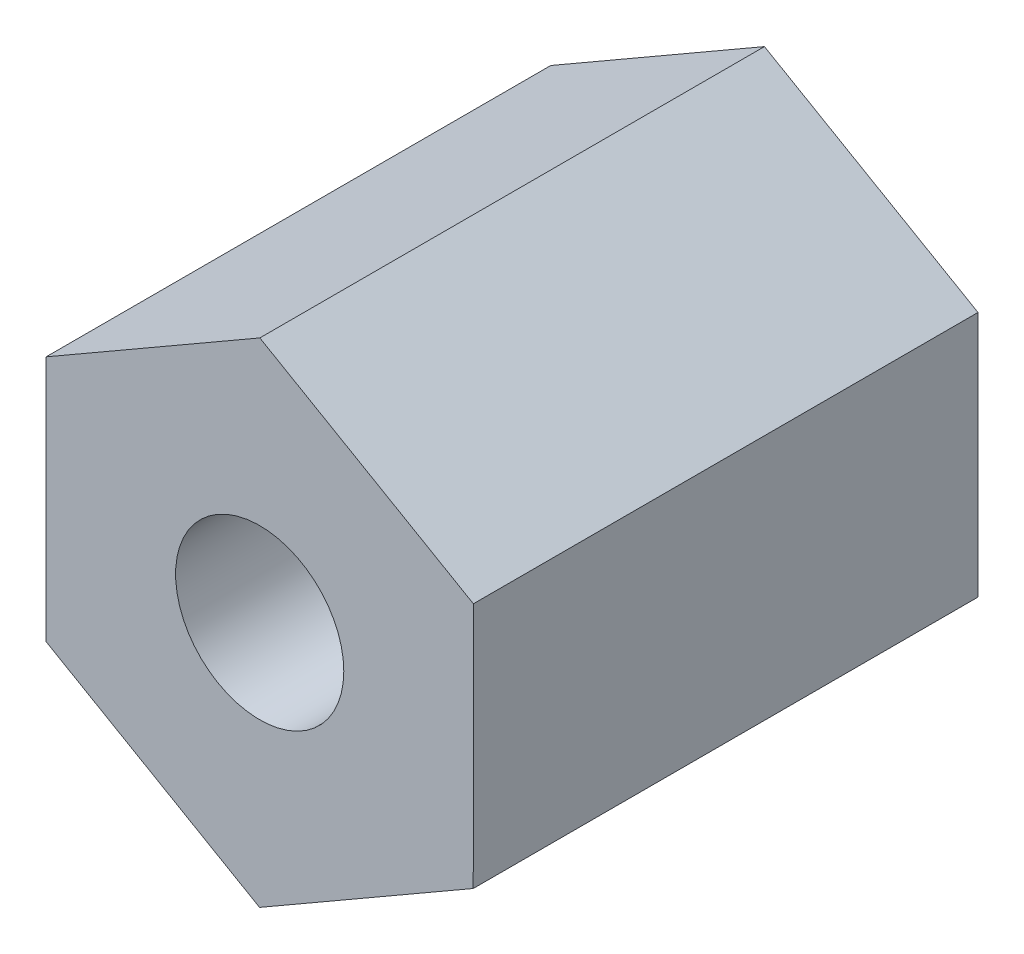
ISO-10303-21;
HEADER;
FILE_DESCRIPTION(('STEP AP214'),'2;1');
FILE_NAME('part.step','',(''),(''),'','','');
FILE_SCHEMA(('AUTOMOTIVE_DESIGN { 1 0 10303 214 1 1 1 1 }'));
ENDSEC;
DATA;
#1=APPLICATION_CONTEXT('core data for automotive mechanical design processes');
#2=APPLICATION_PROTOCOL_DEFINITION('international standard','automotive_design',2000,#1);
#3=PRODUCT_CONTEXT('',#1,'mechanical');
#4=PRODUCT('Part','Part','',(#3));
#5=PRODUCT_RELATED_PRODUCT_CATEGORY('part','',(#4));
#6=PRODUCT_DEFINITION_FORMATION('','',#4);
#7=PRODUCT_DEFINITION_CONTEXT('part definition',#1,'design');
#8=PRODUCT_DEFINITION('design','',#6,#7);
#9=PRODUCT_DEFINITION_SHAPE('','',#8);
#10=(LENGTH_UNIT() NAMED_UNIT(*) SI_UNIT(.MILLI.,.METRE.));
#11=(NAMED_UNIT(*) PLANE_ANGLE_UNIT() SI_UNIT($,.RADIAN.));
#12=(NAMED_UNIT(*) SI_UNIT($,.STERADIAN.) SOLID_ANGLE_UNIT());
#13=UNCERTAINTY_MEASURE_WITH_UNIT(LENGTH_MEASURE(1.E-05),#10,'distance_accuracy_value','');
#14=(GEOMETRIC_REPRESENTATION_CONTEXT(3) GLOBAL_UNCERTAINTY_ASSIGNED_CONTEXT((#13)) GLOBAL_UNIT_ASSIGNED_CONTEXT((#10,
#11,#12)) REPRESENTATION_CONTEXT('',''));
#15=CARTESIAN_POINT('',(0.,0.,0.));
#16=DIRECTION('',(0.,0.,1.));
#17=DIRECTION('',(1.,0.,0.));
#18=AXIS2_PLACEMENT_3D('',#15,#16,#17);
#19=CARTESIAN_POINT('',(0.,0.,15.));
#20=DIRECTION('',(0.,0.,1.));
#21=DIRECTION('',(1.,0.,0.));
#22=AXIS2_PLACEMENT_3D('',#19,#20,#21);
#23=PLANE('',#22);
#24=DIRECTION('',(0.866312371521047,0.499502627570246,0.));
#25=VECTOR('',#24,1.);
#26=CARTESIAN_POINT('',(-0.00421038864380795,-7.3323472098613,15.));
#27=LINE('',#26,#25);
#28=CARTESIAN_POINT('',(-0.00421038864380795,-7.3323472098613,15.));
#29=VERTEX_POINT('',#28);
#30=CARTESIAN_POINT('',(6.34789375878593,-3.669819908456,15.));
#31=VERTEX_POINT('',#30);
#32=EDGE_CURVE('E146',#29,#31,#27,.T.);
#33=ORIENTED_EDGE('',*,*,#32,.T.);
#34=DIRECTION('',(0.000574221027613144,0.999999835135092,0.));
#35=VECTOR('',#34,1.);
#36=CARTESIAN_POINT('',(6.34789375878593,-3.669819908456,15.));
#37=LINE('',#36,#35);
#38=CARTESIAN_POINT('',(6.35210414742974,3.6625273014053,15.));
#39=VERTEX_POINT('',#38);
#40=EDGE_CURVE('E94',#31,#39,#37,.T.);
#41=ORIENTED_EDGE('',*,*,#40,.T.);
#42=DIRECTION('',(-0.865738150493434,0.500497207564846,0.));
#43=VECTOR('',#42,1.);
#44=CARTESIAN_POINT('',(6.35210414742974,3.6625273014053,15.));
#45=LINE('',#44,#43);
#46=CARTESIAN_POINT('',(0.00421038864380947,7.3323472098613,15.));
#47=VERTEX_POINT('',#46);
#48=EDGE_CURVE('E107',#39,#47,#45,.T.);
#49=ORIENTED_EDGE('',*,*,#48,.T.);
#50=DIRECTION('',(-0.866312371521047,-0.499502627570246,0.));
#51=VECTOR('',#50,1.);
#52=CARTESIAN_POINT('',(0.00421038864380947,7.3323472098613,15.));
#53=LINE('',#52,#51);
#54=CARTESIAN_POINT('',(-6.34789375878593,3.66981990845599,15.));
#55=VERTEX_POINT('',#54);
#56=EDGE_CURVE('E101',#47,#55,#53,.T.);
#57=ORIENTED_EDGE('',*,*,#56,.T.);
#58=DIRECTION('',(-0.000574221027613499,-0.999999835135092,0.));
#59=VECTOR('',#58,1.);
#60=CARTESIAN_POINT('',(-6.34789375878593,3.66981990845599,15.));
#61=LINE('',#60,#59);
#62=CARTESIAN_POINT('',(-6.35210414742974,-3.6625273014053,15.));
#63=VERTEX_POINT('',#62);
#64=EDGE_CURVE('E105',#55,#63,#61,.T.);
#65=ORIENTED_EDGE('',*,*,#64,.T.);
#66=DIRECTION('',(0.865738150493433,-0.500497207564847,0.));
#67=VECTOR('',#66,1.);
#68=CARTESIAN_POINT('',(-6.35210414742974,-3.6625273014053,15.));
#69=LINE('',#68,#67);
#70=EDGE_CURVE('E57',#63,#29,#69,.T.);
#71=ORIENTED_EDGE('',*,*,#70,.T.);
#72=EDGE_LOOP('',(#33,#41,#49,#57,#65,#71));
#73=FACE_BOUND('',#72,.T.);
#74=CARTESIAN_POINT('',(0.,0.,15.));
#75=DIRECTION('',(0.,0.,1.));
#76=DIRECTION('',(1.,0.,0.));
#77=AXIS2_PLACEMENT_3D('',#74,#75,#76);
#78=CIRCLE('',#77,2.5);
#79=CARTESIAN_POINT('',(2.5,0.,15.));
#80=VERTEX_POINT('',#79);
#81=EDGE_CURVE('E134',#80,#80,#78,.T.);
#82=ORIENTED_EDGE('',*,*,#81,.F.);
#83=EDGE_LOOP('',(#82));
#84=FACE_BOUND('',#83,.T.);
#85=ADVANCED_FACE('F39',(#73,#84),#23,.T.);
#86=CARTESIAN_POINT('',(0.,0.,0.));
#87=DIRECTION('',(0.,0.,1.));
#88=DIRECTION('',(1.,0.,0.));
#89=AXIS2_PLACEMENT_3D('',#86,#87,#88);
#90=PLANE('',#89);
#91=DIRECTION('',(0.866312371521047,0.499502627570246,0.));
#92=VECTOR('',#91,1.);
#93=CARTESIAN_POINT('',(-0.00421038864380795,-7.3323472098613,0.));
#94=LINE('',#93,#92);
#95=CARTESIAN_POINT('',(-0.00421038864380795,-7.3323472098613,0.));
#96=VERTEX_POINT('',#95);
#97=CARTESIAN_POINT('',(6.34789375878593,-3.669819908456,0.));
#98=VERTEX_POINT('',#97);
#99=EDGE_CURVE('E129',#96,#98,#94,.T.);
#100=ORIENTED_EDGE('',*,*,#99,.F.);
#101=DIRECTION('',(0.865738150493433,-0.500497207564847,0.));
#102=VECTOR('',#101,1.);
#103=CARTESIAN_POINT('',(-6.35210414742974,-3.6625273014053,0.));
#104=LINE('',#103,#102);
#105=CARTESIAN_POINT('',(-6.35210414742974,-3.6625273014053,0.));
#106=VERTEX_POINT('',#105);
#107=EDGE_CURVE('E86',#106,#96,#104,.T.);
#108=ORIENTED_EDGE('',*,*,#107,.F.);
#109=DIRECTION('',(-0.000574221027613499,-0.999999835135092,0.));
#110=VECTOR('',#109,1.);
#111=CARTESIAN_POINT('',(-6.34789375878593,3.66981990845599,0.));
#112=LINE('',#111,#110);
#113=CARTESIAN_POINT('',(-6.34789375878593,3.66981990845599,0.));
#114=VERTEX_POINT('',#113);
#115=EDGE_CURVE('E80',#114,#106,#112,.T.);
#116=ORIENTED_EDGE('',*,*,#115,.F.);
#117=DIRECTION('',(-0.866312371521047,-0.499502627570246,0.));
#118=VECTOR('',#117,1.);
#119=CARTESIAN_POINT('',(0.00421038864380947,7.3323472098613,0.));
#120=LINE('',#119,#118);
#121=CARTESIAN_POINT('',(0.00421038864380947,7.3323472098613,0.));
#122=VERTEX_POINT('',#121);
#123=EDGE_CURVE('E116',#122,#114,#120,.T.);
#124=ORIENTED_EDGE('',*,*,#123,.F.);
#125=DIRECTION('',(-0.865738150493434,0.500497207564846,0.));
#126=VECTOR('',#125,1.);
#127=CARTESIAN_POINT('',(6.35210414742974,3.6625273014053,0.));
#128=LINE('',#127,#126);
#129=CARTESIAN_POINT('',(6.35210414742974,3.6625273014053,0.));
#130=VERTEX_POINT('',#129);
#131=EDGE_CURVE('E137',#130,#122,#128,.T.);
#132=ORIENTED_EDGE('',*,*,#131,.F.);
#133=DIRECTION('',(0.000574221027613144,0.999999835135092,0.));
#134=VECTOR('',#133,1.);
#135=CARTESIAN_POINT('',(6.34789375878593,-3.669819908456,0.));
#136=LINE('',#135,#134);
#137=EDGE_CURVE('E133',#98,#130,#136,.T.);
#138=ORIENTED_EDGE('',*,*,#137,.F.);
#139=EDGE_LOOP('',(#100,#108,#116,#124,#132,#138));
#140=FACE_BOUND('',#139,.T.);
#141=CARTESIAN_POINT('',(0.,0.,0.));
#142=DIRECTION('',(0.,0.,1.));
#143=DIRECTION('',(1.,0.,0.));
#144=AXIS2_PLACEMENT_3D('',#141,#142,#143);
#145=CIRCLE('',#144,2.5);
#146=CARTESIAN_POINT('',(2.5,0.,0.));
#147=VERTEX_POINT('',#146);
#148=EDGE_CURVE('E243',#147,#147,#145,.T.);
#149=ORIENTED_EDGE('',*,*,#148,.T.);
#150=EDGE_LOOP('',(#149));
#151=FACE_BOUND('',#150,.T.);
#152=ADVANCED_FACE('F159',(#140,#151),#90,.F.);
#153=CARTESIAN_POINT('',(-0.00421038864380795,-7.3323472098613,15.));
#154=DIRECTION('',(-0.499502627570246,0.866312371521047,0.));
#155=DIRECTION('',(-0.866312371521047,-0.499502627570246,0.));
#156=AXIS2_PLACEMENT_3D('',#153,#154,#155);
#157=PLANE('',#156);
#158=ORIENTED_EDGE('',*,*,#99,.T.);
#159=DIRECTION('',(0.,0.,-1.));
#160=VECTOR('',#159,1.);
#161=CARTESIAN_POINT('',(6.34789375878593,-3.669819908456,15.));
#162=LINE('',#161,#160);
#163=EDGE_CURVE('E11',#31,#98,#162,.T.);
#164=ORIENTED_EDGE('',*,*,#163,.F.);
#165=ORIENTED_EDGE('',*,*,#32,.F.);
#166=DIRECTION('',(0.,0.,-1.));
#167=VECTOR('',#166,1.);
#168=CARTESIAN_POINT('',(-0.00421038864380795,-7.3323472098613,15.));
#169=LINE('',#168,#167);
#170=EDGE_CURVE('E125',#29,#96,#169,.T.);
#171=ORIENTED_EDGE('',*,*,#170,.T.);
#172=EDGE_LOOP('',(#158,#164,#165,#171));
#173=FACE_BOUND('',#172,.T.);
#174=ADVANCED_FACE('F41',(#173),#157,.F.);
#175=CARTESIAN_POINT('',(6.34789375878593,-3.669819908456,15.));
#176=DIRECTION('',(-0.999999835135092,0.000574221027613144,0.));
#177=DIRECTION('',(-0.000574221027613144,-0.999999835135092,0.));
#178=AXIS2_PLACEMENT_3D('',#175,#176,#177);
#179=PLANE('',#178);
#180=ORIENTED_EDGE('',*,*,#137,.T.);
#181=DIRECTION('',(0.,0.,-1.));
#182=VECTOR('',#181,1.);
#183=CARTESIAN_POINT('',(6.35210414742974,3.6625273014053,15.));
#184=LINE('',#183,#182);
#185=EDGE_CURVE('E49',#39,#130,#184,.T.);
#186=ORIENTED_EDGE('',*,*,#185,.F.);
#187=ORIENTED_EDGE('',*,*,#40,.F.);
#188=ORIENTED_EDGE('',*,*,#163,.T.);
#189=EDGE_LOOP('',(#180,#186,#187,#188));
#190=FACE_BOUND('',#189,.T.);
#191=ADVANCED_FACE('F184',(#190),#179,.F.);
#192=CARTESIAN_POINT('',(6.35210414742974,3.6625273014053,15.));
#193=DIRECTION('',(-0.500497207564846,-0.865738150493434,0.));
#194=DIRECTION('',(0.865738150493434,-0.500497207564846,0.));
#195=AXIS2_PLACEMENT_3D('',#192,#193,#194);
#196=PLANE('',#195);
#197=ORIENTED_EDGE('',*,*,#131,.T.);
#198=DIRECTION('',(0.,0.,-1.));
#199=VECTOR('',#198,1.);
#200=CARTESIAN_POINT('',(0.00421038864380947,7.3323472098613,15.));
#201=LINE('',#200,#199);
#202=EDGE_CURVE('E118',#47,#122,#201,.T.);
#203=ORIENTED_EDGE('',*,*,#202,.F.);
#204=ORIENTED_EDGE('',*,*,#48,.F.);
#205=ORIENTED_EDGE('',*,*,#185,.T.);
#206=EDGE_LOOP('',(#197,#203,#204,#205));
#207=FACE_BOUND('',#206,.T.);
#208=ADVANCED_FACE('F156',(#207),#196,.F.);
#209=CARTESIAN_POINT('',(0.00421038864380947,7.3323472098613,15.));
#210=DIRECTION('',(0.499502627570246,-0.866312371521047,0.));
#211=DIRECTION('',(0.866312371521047,0.499502627570246,0.));
#212=AXIS2_PLACEMENT_3D('',#209,#210,#211);
#213=PLANE('',#212);
#214=ORIENTED_EDGE('',*,*,#123,.T.);
#215=DIRECTION('',(0.,0.,-1.));
#216=VECTOR('',#215,1.);
#217=CARTESIAN_POINT('',(-6.34789375878593,3.66981990845599,15.));
#218=LINE('',#217,#216);
#219=EDGE_CURVE('E113',#55,#114,#218,.T.);
#220=ORIENTED_EDGE('',*,*,#219,.F.);
#221=ORIENTED_EDGE('',*,*,#56,.F.);
#222=ORIENTED_EDGE('',*,*,#202,.T.);
#223=EDGE_LOOP('',(#214,#220,#221,#222));
#224=FACE_BOUND('',#223,.T.);
#225=ADVANCED_FACE('F114',(#224),#213,.F.);
#226=CARTESIAN_POINT('',(-6.34789375878593,3.66981990845599,15.));
#227=DIRECTION('',(0.999999835135092,-0.000574221027613499,0.));
#228=DIRECTION('',(0.000574221027613499,0.999999835135092,0.));
#229=AXIS2_PLACEMENT_3D('',#226,#227,#228);
#230=PLANE('',#229);
#231=ORIENTED_EDGE('',*,*,#115,.T.);
#232=DIRECTION('',(0.,0.,-1.));
#233=VECTOR('',#232,1.);
#234=CARTESIAN_POINT('',(-6.35210414742974,-3.6625273014053,15.));
#235=LINE('',#234,#233);
#236=EDGE_CURVE('E119',#63,#106,#235,.T.);
#237=ORIENTED_EDGE('',*,*,#236,.F.);
#238=ORIENTED_EDGE('',*,*,#64,.F.);
#239=ORIENTED_EDGE('',*,*,#219,.T.);
#240=EDGE_LOOP('',(#231,#237,#238,#239));
#241=FACE_BOUND('',#240,.T.);
#242=ADVANCED_FACE('F121',(#241),#230,.F.);
#243=CARTESIAN_POINT('',(-6.35210414742974,-3.6625273014053,15.));
#244=DIRECTION('',(0.500497207564847,0.865738150493433,0.));
#245=DIRECTION('',(-0.865738150493433,0.500497207564847,0.));
#246=AXIS2_PLACEMENT_3D('',#243,#244,#245);
#247=PLANE('',#246);
#248=ORIENTED_EDGE('',*,*,#107,.T.);
#249=ORIENTED_EDGE('',*,*,#170,.F.);
#250=ORIENTED_EDGE('',*,*,#70,.F.);
#251=ORIENTED_EDGE('',*,*,#236,.T.);
#252=EDGE_LOOP('',(#248,#249,#250,#251));
#253=FACE_BOUND('',#252,.T.);
#254=ADVANCED_FACE('F164',(#253),#247,.F.);
#255=CARTESIAN_POINT('',(0.,0.,15.));
#256=DIRECTION('',(0.,0.,-1.));
#257=DIRECTION('',(-1.,0.,0.));
#258=AXIS2_PLACEMENT_3D('',#255,#256,#257);
#259=CYLINDRICAL_SURFACE('',#258,2.5);
#260=ORIENTED_EDGE('',*,*,#81,.T.);
#261=EDGE_LOOP('',(#260));
#262=FACE_BOUND('',#261,.T.);
#263=ORIENTED_EDGE('',*,*,#148,.F.);
#264=EDGE_LOOP('',(#263));
#265=FACE_BOUND('',#264,.T.);
#266=ADVANCED_FACE('F166',(#262,#265),#259,.F.);
#267=CLOSED_SHELL('',(#85,#152,#174,#191,#208,#225,#242,#254,#266));
#268=MANIFOLD_SOLID_BREP('B2',#267);
#269=ADVANCED_BREP_SHAPE_REPRESENTATION('',(#18,#268),#14);
#270=SHAPE_DEFINITION_REPRESENTATION(#9,#269);
ENDSEC;
END-ISO-10303-21;
